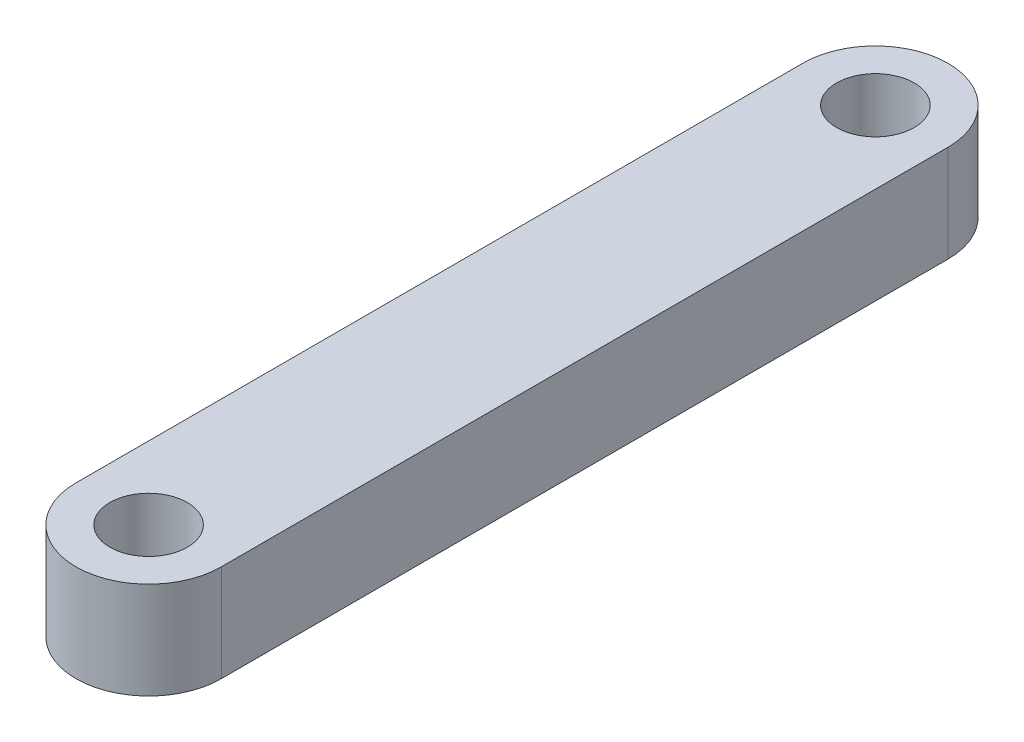
ISO-10303-21;
HEADER;
FILE_DESCRIPTION(('STEP AP214'),'2;1');
FILE_NAME('part.step','',(''),(''),'','','');
FILE_SCHEMA(('AUTOMOTIVE_DESIGN { 1 0 10303 214 1 1 1 1 }'));
ENDSEC;
DATA;
#1=APPLICATION_CONTEXT('core data for automotive mechanical design processes');
#2=APPLICATION_PROTOCOL_DEFINITION('international standard','automotive_design',2000,#1);
#3=PRODUCT_CONTEXT('',#1,'mechanical');
#4=PRODUCT('Part','Part','',(#3));
#5=PRODUCT_RELATED_PRODUCT_CATEGORY('part','',(#4));
#6=PRODUCT_DEFINITION_FORMATION('','',#4);
#7=PRODUCT_DEFINITION_CONTEXT('part definition',#1,'design');
#8=PRODUCT_DEFINITION('design','',#6,#7);
#9=PRODUCT_DEFINITION_SHAPE('','',#8);
#10=(LENGTH_UNIT() NAMED_UNIT(*) SI_UNIT(.MILLI.,.METRE.));
#11=(NAMED_UNIT(*) PLANE_ANGLE_UNIT() SI_UNIT($,.RADIAN.));
#12=(NAMED_UNIT(*) SI_UNIT($,.STERADIAN.) SOLID_ANGLE_UNIT());
#13=UNCERTAINTY_MEASURE_WITH_UNIT(LENGTH_MEASURE(1.E-05),#10,'distance_accuracy_value','');
#14=(GEOMETRIC_REPRESENTATION_CONTEXT(3) GLOBAL_UNCERTAINTY_ASSIGNED_CONTEXT((#13)) GLOBAL_UNIT_ASSIGNED_CONTEXT((#10,
#11,#12)) REPRESENTATION_CONTEXT('',''));
#15=CARTESIAN_POINT('',(0.,0.,0.));
#16=DIRECTION('',(0.,0.,1.));
#17=DIRECTION('',(1.,0.,0.));
#18=AXIS2_PLACEMENT_3D('',#15,#16,#17);
#19=CARTESIAN_POINT('',(0.,2.,7.5));
#20=DIRECTION('',(0.,-1.,0.));
#21=DIRECTION('',(0.,0.,-1.));
#22=AXIS2_PLACEMENT_3D('',#19,#20,#21);
#23=PLANE('',#22);
#24=CARTESIAN_POINT('',(0.,2.,7.5));
#25=DIRECTION('',(0.,1.,0.));
#26=DIRECTION('',(0.,0.,-1.));
#27=AXIS2_PLACEMENT_3D('',#24,#25,#26);
#28=CIRCLE('',#27,1.5);
#29=CARTESIAN_POINT('',(-1.5,2.,7.5));
#30=VERTEX_POINT('',#29);
#31=CARTESIAN_POINT('',(1.5,2.,7.5));
#32=VERTEX_POINT('',#31);
#33=EDGE_CURVE('E84',#30,#32,#28,.T.);
#34=ORIENTED_EDGE('',*,*,#33,.T.);
#35=DIRECTION('',(0.,0.,-1.));
#36=VECTOR('',#35,1.);
#37=CARTESIAN_POINT('',(1.5,2.,-7.5));
#38=LINE('',#37,#36);
#39=CARTESIAN_POINT('',(1.5,2.,-7.5));
#40=VERTEX_POINT('',#39);
#41=EDGE_CURVE('E79',#32,#40,#38,.T.);
#42=ORIENTED_EDGE('',*,*,#41,.T.);
#43=CARTESIAN_POINT('',(0.,2.,-7.5));
#44=DIRECTION('',(0.,1.,0.));
#45=DIRECTION('',(0.,0.,1.));
#46=AXIS2_PLACEMENT_3D('',#43,#44,#45);
#47=CIRCLE('',#46,1.5);
#48=CARTESIAN_POINT('',(-1.5,2.,-7.5));
#49=VERTEX_POINT('',#48);
#50=EDGE_CURVE('E82',#40,#49,#47,.T.);
#51=ORIENTED_EDGE('',*,*,#50,.T.);
#52=DIRECTION('',(0.,0.,1.));
#53=VECTOR('',#52,1.);
#54=CARTESIAN_POINT('',(-1.5,2.,-7.5));
#55=LINE('',#54,#53);
#56=EDGE_CURVE('E49',#49,#30,#55,.T.);
#57=ORIENTED_EDGE('',*,*,#56,.T.);
#58=EDGE_LOOP('',(#34,#42,#51,#57));
#59=FACE_BOUND('',#58,.T.);
#60=CARTESIAN_POINT('',(0.,2.,7.5));
#61=DIRECTION('',(0.,1.,0.));
#62=DIRECTION('',(0.,0.,1.));
#63=AXIS2_PLACEMENT_3D('',#60,#61,#62);
#64=CIRCLE('',#63,0.800000000000001);
#65=CARTESIAN_POINT('',(0.,2.,8.3));
#66=VERTEX_POINT('',#65);
#67=EDGE_CURVE('E99',#66,#66,#64,.T.);
#68=ORIENTED_EDGE('',*,*,#67,.F.);
#69=EDGE_LOOP('',(#68));
#70=FACE_BOUND('',#69,.T.);
#71=CARTESIAN_POINT('',(0.,2.,-7.5));
#72=DIRECTION('',(0.,1.,0.));
#73=DIRECTION('',(0.,0.,1.));
#74=AXIS2_PLACEMENT_3D('',#71,#72,#73);
#75=CIRCLE('',#74,0.800000000000001);
#76=CARTESIAN_POINT('',(0.,2.,-6.7));
#77=VERTEX_POINT('',#76);
#78=EDGE_CURVE('E114',#77,#77,#75,.T.);
#79=ORIENTED_EDGE('',*,*,#78,.F.);
#80=EDGE_LOOP('',(#79));
#81=FACE_BOUND('',#80,.T.);
#82=ADVANCED_FACE('F32',(#59,#70,#81),#23,.F.);
#83=CARTESIAN_POINT('',(0.,0.,7.5));
#84=DIRECTION('',(0.,-1.,0.));
#85=DIRECTION('',(0.,0.,-1.));
#86=AXIS2_PLACEMENT_3D('',#83,#84,#85);
#87=PLANE('',#86);
#88=CARTESIAN_POINT('',(0.,0.,7.5));
#89=DIRECTION('',(0.,1.,0.));
#90=DIRECTION('',(0.,0.,1.));
#91=AXIS2_PLACEMENT_3D('',#88,#89,#90);
#92=CIRCLE('',#91,0.800000000000001);
#93=CARTESIAN_POINT('',(0.,0.,8.3));
#94=VERTEX_POINT('',#93);
#95=EDGE_CURVE('E111',#94,#94,#92,.T.);
#96=ORIENTED_EDGE('',*,*,#95,.T.);
#97=EDGE_LOOP('',(#96));
#98=FACE_BOUND('',#97,.T.);
#99=CARTESIAN_POINT('',(0.,0.,7.5));
#100=DIRECTION('',(0.,1.,0.));
#101=DIRECTION('',(0.,0.,-1.));
#102=AXIS2_PLACEMENT_3D('',#99,#100,#101);
#103=CIRCLE('',#102,1.5);
#104=CARTESIAN_POINT('',(-1.5,0.,7.5));
#105=VERTEX_POINT('',#104);
#106=CARTESIAN_POINT('',(1.5,0.,7.5));
#107=VERTEX_POINT('',#106);
#108=EDGE_CURVE('E96',#105,#107,#103,.T.);
#109=ORIENTED_EDGE('',*,*,#108,.F.);
#110=DIRECTION('',(0.,0.,1.));
#111=VECTOR('',#110,1.);
#112=CARTESIAN_POINT('',(-1.5,0.,-7.5));
#113=LINE('',#112,#111);
#114=CARTESIAN_POINT('',(-1.5,0.,-7.5));
#115=VERTEX_POINT('',#114);
#116=EDGE_CURVE('E72',#115,#105,#113,.T.);
#117=ORIENTED_EDGE('',*,*,#116,.F.);
#118=CARTESIAN_POINT('',(0.,0.,-7.5));
#119=DIRECTION('',(0.,1.,0.));
#120=DIRECTION('',(0.,0.,1.));
#121=AXIS2_PLACEMENT_3D('',#118,#119,#120);
#122=CIRCLE('',#121,1.5);
#123=CARTESIAN_POINT('',(1.5,0.,-7.5));
#124=VERTEX_POINT('',#123);
#125=EDGE_CURVE('E66',#124,#115,#122,.T.);
#126=ORIENTED_EDGE('',*,*,#125,.F.);
#127=DIRECTION('',(0.,0.,-1.));
#128=VECTOR('',#127,1.);
#129=CARTESIAN_POINT('',(1.5,0.,-7.5));
#130=LINE('',#129,#128);
#131=EDGE_CURVE('E88',#107,#124,#130,.T.);
#132=ORIENTED_EDGE('',*,*,#131,.F.);
#133=EDGE_LOOP('',(#109,#117,#126,#132));
#134=FACE_BOUND('',#133,.T.);
#135=CARTESIAN_POINT('',(0.,0.,-7.5));
#136=DIRECTION('',(0.,1.,0.));
#137=DIRECTION('',(0.,0.,1.));
#138=AXIS2_PLACEMENT_3D('',#135,#136,#137);
#139=CIRCLE('',#138,0.800000000000001);
#140=CARTESIAN_POINT('',(0.,0.,-6.7));
#141=VERTEX_POINT('',#140);
#142=EDGE_CURVE('E117',#141,#141,#139,.T.);
#143=ORIENTED_EDGE('',*,*,#142,.T.);
#144=EDGE_LOOP('',(#143));
#145=FACE_BOUND('',#144,.T.);
#146=ADVANCED_FACE('F107',(#98,#134,#145),#87,.T.);
#147=CARTESIAN_POINT('',(0.,2.,7.5));
#148=DIRECTION('',(0.,-1.,0.));
#149=DIRECTION('',(0.,0.,-1.));
#150=AXIS2_PLACEMENT_3D('',#147,#148,#149);
#151=CYLINDRICAL_SURFACE('',#150,1.5);
#152=ORIENTED_EDGE('',*,*,#108,.T.);
#153=DIRECTION('',(0.,-1.,0.));
#154=VECTOR('',#153,1.);
#155=CARTESIAN_POINT('',(1.5,2.,7.5));
#156=LINE('',#155,#154);
#157=EDGE_CURVE('E11',#32,#107,#156,.T.);
#158=ORIENTED_EDGE('',*,*,#157,.F.);
#159=ORIENTED_EDGE('',*,*,#33,.F.);
#160=DIRECTION('',(0.,-1.,0.));
#161=VECTOR('',#160,1.);
#162=CARTESIAN_POINT('',(-1.5,2.,7.5));
#163=LINE('',#162,#161);
#164=EDGE_CURVE('E92',#30,#105,#163,.T.);
#165=ORIENTED_EDGE('',*,*,#164,.T.);
#166=EDGE_LOOP('',(#152,#158,#159,#165));
#167=FACE_BOUND('',#166,.T.);
#168=ADVANCED_FACE('F34',(#167),#151,.T.);
#169=CARTESIAN_POINT('',(1.5,2.,-7.5));
#170=DIRECTION('',(-1.,0.,0.));
#171=DIRECTION('',(0.,0.,1.));
#172=AXIS2_PLACEMENT_3D('',#169,#170,#171);
#173=PLANE('',#172);
#174=ORIENTED_EDGE('',*,*,#131,.T.);
#175=DIRECTION('',(0.,-1.,0.));
#176=VECTOR('',#175,1.);
#177=CARTESIAN_POINT('',(1.5,2.,-7.5));
#178=LINE('',#177,#176);
#179=EDGE_CURVE('E41',#40,#124,#178,.T.);
#180=ORIENTED_EDGE('',*,*,#179,.F.);
#181=ORIENTED_EDGE('',*,*,#41,.F.);
#182=ORIENTED_EDGE('',*,*,#157,.T.);
#183=EDGE_LOOP('',(#174,#180,#181,#182));
#184=FACE_BOUND('',#183,.T.);
#185=ADVANCED_FACE('F87',(#184),#173,.F.);
#186=CARTESIAN_POINT('',(0.,2.,-7.5));
#187=DIRECTION('',(0.,-1.,0.));
#188=DIRECTION('',(0.,0.,-1.));
#189=AXIS2_PLACEMENT_3D('',#186,#187,#188);
#190=CYLINDRICAL_SURFACE('',#189,1.5);
#191=ORIENTED_EDGE('',*,*,#125,.T.);
#192=DIRECTION('',(0.,-1.,0.));
#193=VECTOR('',#192,1.);
#194=CARTESIAN_POINT('',(-1.5,2.,-7.5));
#195=LINE('',#194,#193);
#196=EDGE_CURVE('E89',#49,#115,#195,.T.);
#197=ORIENTED_EDGE('',*,*,#196,.F.);
#198=ORIENTED_EDGE('',*,*,#50,.F.);
#199=ORIENTED_EDGE('',*,*,#179,.T.);
#200=EDGE_LOOP('',(#191,#197,#198,#199));
#201=FACE_BOUND('',#200,.T.);
#202=ADVANCED_FACE('F90',(#201),#190,.T.);
#203=CARTESIAN_POINT('',(-1.5,2.,-7.5));
#204=DIRECTION('',(1.,0.,0.));
#205=DIRECTION('',(0.,0.,-1.));
#206=AXIS2_PLACEMENT_3D('',#203,#204,#205);
#207=PLANE('',#206);
#208=ORIENTED_EDGE('',*,*,#116,.T.);
#209=ORIENTED_EDGE('',*,*,#164,.F.);
#210=ORIENTED_EDGE('',*,*,#56,.F.);
#211=ORIENTED_EDGE('',*,*,#196,.T.);
#212=EDGE_LOOP('',(#208,#209,#210,#211));
#213=FACE_BOUND('',#212,.T.);
#214=ADVANCED_FACE('F104',(#213),#207,.F.);
#215=CARTESIAN_POINT('',(0.,2.,7.5));
#216=DIRECTION('',(0.,-1.,0.));
#217=DIRECTION('',(0.,0.,-1.));
#218=AXIS2_PLACEMENT_3D('',#215,#216,#217);
#219=CYLINDRICAL_SURFACE('',#218,0.800000000000001);
#220=ORIENTED_EDGE('',*,*,#67,.T.);
#221=EDGE_LOOP('',(#220));
#222=FACE_BOUND('',#221,.T.);
#223=ORIENTED_EDGE('',*,*,#95,.F.);
#224=EDGE_LOOP('',(#223));
#225=FACE_BOUND('',#224,.T.);
#226=ADVANCED_FACE('F134',(#222,#225),#219,.F.);
#227=CARTESIAN_POINT('',(0.,2.,-7.5));
#228=DIRECTION('',(0.,-1.,0.));
#229=DIRECTION('',(0.,0.,-1.));
#230=AXIS2_PLACEMENT_3D('',#227,#228,#229);
#231=CYLINDRICAL_SURFACE('',#230,0.800000000000001);
#232=ORIENTED_EDGE('',*,*,#78,.T.);
#233=EDGE_LOOP('',(#232));
#234=FACE_BOUND('',#233,.T.);
#235=ORIENTED_EDGE('',*,*,#142,.F.);
#236=EDGE_LOOP('',(#235));
#237=FACE_BOUND('',#236,.T.);
#238=ADVANCED_FACE('F123',(#234,#237),#231,.F.);
#239=CLOSED_SHELL('',(#82,#146,#168,#185,#202,#214,#226,#238));
#240=MANIFOLD_SOLID_BREP('B2',#239);
#241=ADVANCED_BREP_SHAPE_REPRESENTATION('',(#18,#240),#14);
#242=SHAPE_DEFINITION_REPRESENTATION(#9,#241);
ENDSEC;
END-ISO-10303-21;
